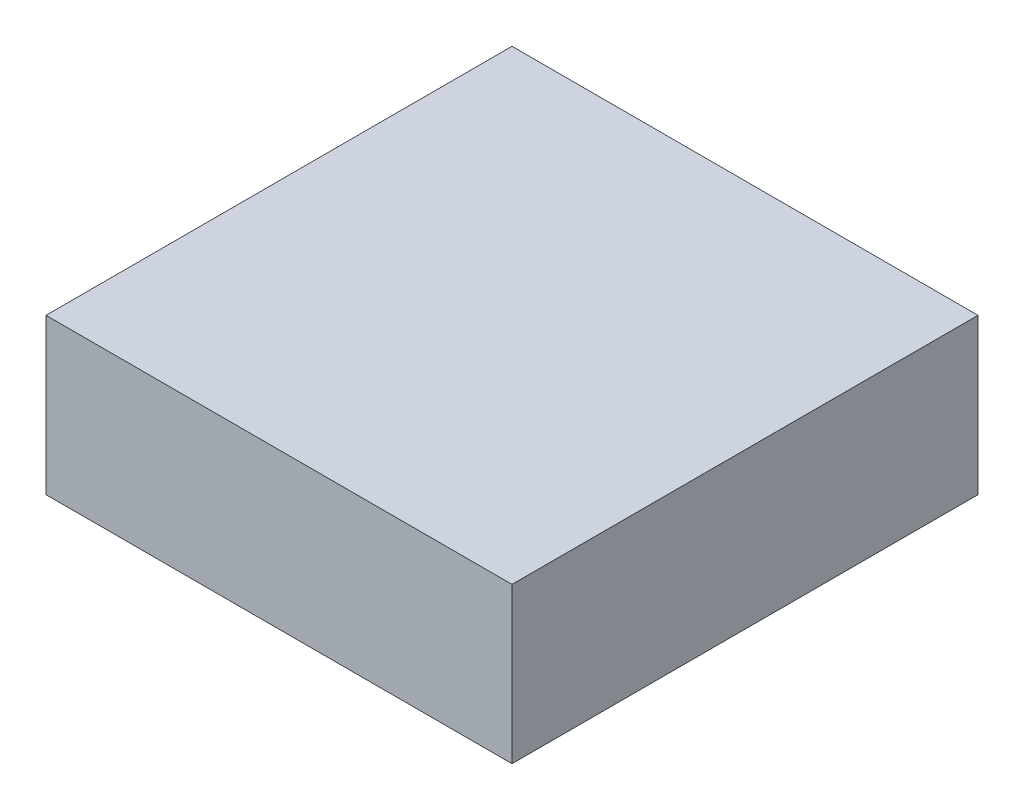
ISO-10303-21;
HEADER;
FILE_DESCRIPTION(('STEP AP214'),'2;1');
FILE_NAME('part.step','',(''),(''),'','','');
FILE_SCHEMA(('AUTOMOTIVE_DESIGN { 1 0 10303 214 1 1 1 1 }'));
ENDSEC;
DATA;
#1=APPLICATION_CONTEXT('core data for automotive mechanical design processes');
#2=APPLICATION_PROTOCOL_DEFINITION('international standard','automotive_design',2000,#1);
#3=PRODUCT_CONTEXT('',#1,'mechanical');
#4=PRODUCT('Part','Part','',(#3));
#5=PRODUCT_RELATED_PRODUCT_CATEGORY('part','',(#4));
#6=PRODUCT_DEFINITION_FORMATION('','',#4);
#7=PRODUCT_DEFINITION_CONTEXT('part definition',#1,'design');
#8=PRODUCT_DEFINITION('design','',#6,#7);
#9=PRODUCT_DEFINITION_SHAPE('','',#8);
#10=(LENGTH_UNIT() NAMED_UNIT(*) SI_UNIT(.MILLI.,.METRE.));
#11=(NAMED_UNIT(*) PLANE_ANGLE_UNIT() SI_UNIT($,.RADIAN.));
#12=(NAMED_UNIT(*) SI_UNIT($,.STERADIAN.) SOLID_ANGLE_UNIT());
#13=UNCERTAINTY_MEASURE_WITH_UNIT(LENGTH_MEASURE(1.E-05),#10,'distance_accuracy_value','');
#14=(GEOMETRIC_REPRESENTATION_CONTEXT(3) GLOBAL_UNCERTAINTY_ASSIGNED_CONTEXT((#13)) GLOBAL_UNIT_ASSIGNED_CONTEXT((#10,
#11,#12)) REPRESENTATION_CONTEXT('',''));
#15=CARTESIAN_POINT('',(0.,0.,0.));
#16=DIRECTION('',(0.,0.,1.));
#17=DIRECTION('',(1.,0.,0.));
#18=AXIS2_PLACEMENT_3D('',#15,#16,#17);
#19=CARTESIAN_POINT('',(-89.3347800287974,-30.,52.4178960442944));
#20=DIRECTION('',(-1.,0.,0.));
#21=DIRECTION('',(0.,0.,1.));
#22=AXIS2_PLACEMENT_3D('',#19,#20,#21);
#23=PLANE('',#22);
#24=DIRECTION('',(0.,0.,1.));
#25=VECTOR('',#24,1.);
#26=CARTESIAN_POINT('',(-89.3347800287974,0.,52.4178960442944));
#27=LINE('',#26,#25);
#28=CARTESIAN_POINT('',(-89.3347800287974,0.,-37.5821039557056));
#29=VERTEX_POINT('',#28);
#30=CARTESIAN_POINT('',(-89.3347800287974,0.,52.4178960442944));
#31=VERTEX_POINT('',#30);
#32=EDGE_CURVE('E109',#29,#31,#27,.T.);
#33=ORIENTED_EDGE('',*,*,#32,.F.);
#34=DIRECTION('',(0.,1.,0.));
#35=VECTOR('',#34,1.);
#36=CARTESIAN_POINT('',(-89.3347800287974,-30.,-37.5821039557056));
#37=LINE('',#36,#35);
#38=CARTESIAN_POINT('',(-89.3347800287974,-30.,-37.5821039557056));
#39=VERTEX_POINT('',#38);
#40=EDGE_CURVE('E11',#39,#29,#37,.T.);
#41=ORIENTED_EDGE('',*,*,#40,.F.);
#42=DIRECTION('',(0.,0.,1.));
#43=VECTOR('',#42,1.);
#44=CARTESIAN_POINT('',(-89.3347800287974,-30.,52.4178960442944));
#45=LINE('',#44,#43);
#46=CARTESIAN_POINT('',(-89.3347800287974,-30.,52.4178960442944));
#47=VERTEX_POINT('',#46);
#48=EDGE_CURVE('E101',#39,#47,#45,.T.);
#49=ORIENTED_EDGE('',*,*,#48,.T.);
#50=DIRECTION('',(0.,1.,0.));
#51=VECTOR('',#50,1.);
#52=CARTESIAN_POINT('',(-89.3347800287974,-30.,52.4178960442944));
#53=LINE('',#52,#51);
#54=EDGE_CURVE('E42',#47,#31,#53,.T.);
#55=ORIENTED_EDGE('',*,*,#54,.T.);
#56=EDGE_LOOP('',(#33,#41,#49,#55));
#57=FACE_BOUND('',#56,.T.);
#58=ADVANCED_FACE('F39',(#57),#23,.T.);
#59=CARTESIAN_POINT('',(-89.3347800287974,-30.,-37.5821039557056));
#60=DIRECTION('',(0.,0.,-1.));
#61=DIRECTION('',(-1.,0.,0.));
#62=AXIS2_PLACEMENT_3D('',#59,#60,#61);
#63=PLANE('',#62);
#64=DIRECTION('',(-1.,0.,0.));
#65=VECTOR('',#64,1.);
#66=CARTESIAN_POINT('',(-89.3347800287974,0.,-37.5821039557056));
#67=LINE('',#66,#65);
#68=CARTESIAN_POINT('',(0.665219971202585,0.,-37.5821039557056));
#69=VERTEX_POINT('',#68);
#70=EDGE_CURVE('E104',#69,#29,#67,.T.);
#71=ORIENTED_EDGE('',*,*,#70,.F.);
#72=DIRECTION('',(0.,1.,0.));
#73=VECTOR('',#72,1.);
#74=CARTESIAN_POINT('',(0.665219971202585,-30.,-37.5821039557056));
#75=LINE('',#74,#73);
#76=CARTESIAN_POINT('',(0.665219971202585,-30.,-37.5821039557056));
#77=VERTEX_POINT('',#76);
#78=EDGE_CURVE('E49',#77,#69,#75,.T.);
#79=ORIENTED_EDGE('',*,*,#78,.F.);
#80=DIRECTION('',(-1.,0.,0.));
#81=VECTOR('',#80,1.);
#82=CARTESIAN_POINT('',(-89.3347800287974,-30.,-37.5821039557056));
#83=LINE('',#82,#81);
#84=EDGE_CURVE('E96',#77,#39,#83,.T.);
#85=ORIENTED_EDGE('',*,*,#84,.T.);
#86=ORIENTED_EDGE('',*,*,#40,.T.);
#87=EDGE_LOOP('',(#71,#79,#85,#86));
#88=FACE_BOUND('',#87,.T.);
#89=ADVANCED_FACE('F125',(#88),#63,.T.);
#90=CARTESIAN_POINT('',(0.665219971202585,-30.,52.4178960442944));
#91=DIRECTION('',(1.,0.,0.));
#92=DIRECTION('',(0.,0.,-1.));
#93=AXIS2_PLACEMENT_3D('',#90,#91,#92);
#94=PLANE('',#93);
#95=DIRECTION('',(0.,0.,-1.));
#96=VECTOR('',#95,1.);
#97=CARTESIAN_POINT('',(0.665219971202585,0.,52.4178960442944));
#98=LINE('',#97,#96);
#99=CARTESIAN_POINT('',(0.665219971202585,0.,52.4178960442944));
#100=VERTEX_POINT('',#99);
#101=EDGE_CURVE('E90',#100,#69,#98,.T.);
#102=ORIENTED_EDGE('',*,*,#101,.F.);
#103=DIRECTION('',(0.,1.,0.));
#104=VECTOR('',#103,1.);
#105=CARTESIAN_POINT('',(0.665219971202585,-30.,52.4178960442944));
#106=LINE('',#105,#104);
#107=CARTESIAN_POINT('',(0.665219971202585,-30.,52.4178960442944));
#108=VERTEX_POINT('',#107);
#109=EDGE_CURVE('E85',#108,#100,#106,.T.);
#110=ORIENTED_EDGE('',*,*,#109,.F.);
#111=DIRECTION('',(0.,0.,-1.));
#112=VECTOR('',#111,1.);
#113=CARTESIAN_POINT('',(0.665219971202585,-30.,52.4178960442944));
#114=LINE('',#113,#112);
#115=EDGE_CURVE('E88',#108,#77,#114,.T.);
#116=ORIENTED_EDGE('',*,*,#115,.T.);
#117=ORIENTED_EDGE('',*,*,#78,.T.);
#118=EDGE_LOOP('',(#102,#110,#116,#117));
#119=FACE_BOUND('',#118,.T.);
#120=ADVANCED_FACE('F87',(#119),#94,.T.);
#121=CARTESIAN_POINT('',(-89.3347800287974,-30.,52.4178960442944));
#122=DIRECTION('',(0.,0.,1.));
#123=DIRECTION('',(1.,0.,0.));
#124=AXIS2_PLACEMENT_3D('',#121,#122,#123);
#125=PLANE('',#124);
#126=DIRECTION('',(1.,0.,0.));
#127=VECTOR('',#126,1.);
#128=CARTESIAN_POINT('',(-89.3347800287974,0.,52.4178960442944));
#129=LINE('',#128,#127);
#130=EDGE_CURVE('E113',#31,#100,#129,.T.);
#131=ORIENTED_EDGE('',*,*,#130,.F.);
#132=ORIENTED_EDGE('',*,*,#54,.F.);
#133=DIRECTION('',(1.,0.,0.));
#134=VECTOR('',#133,1.);
#135=CARTESIAN_POINT('',(-89.3347800287974,-30.,52.4178960442944));
#136=LINE('',#135,#134);
#137=EDGE_CURVE('E95',#47,#108,#136,.T.);
#138=ORIENTED_EDGE('',*,*,#137,.T.);
#139=ORIENTED_EDGE('',*,*,#109,.T.);
#140=EDGE_LOOP('',(#131,#132,#138,#139));
#141=FACE_BOUND('',#140,.T.);
#142=ADVANCED_FACE('F99',(#141),#125,.T.);
#143=CARTESIAN_POINT('',(0.,-30.,0.));
#144=DIRECTION('',(0.,-1.,0.));
#145=DIRECTION('',(0.,0.,-1.));
#146=AXIS2_PLACEMENT_3D('',#143,#144,#145);
#147=PLANE('',#146);
#148=ORIENTED_EDGE('',*,*,#48,.F.);
#149=ORIENTED_EDGE('',*,*,#84,.F.);
#150=ORIENTED_EDGE('',*,*,#115,.F.);
#151=ORIENTED_EDGE('',*,*,#137,.F.);
#152=EDGE_LOOP('',(#148,#149,#150,#151));
#153=FACE_BOUND('',#152,.T.);
#154=ADVANCED_FACE('F94',(#153),#147,.T.);
#155=CARTESIAN_POINT('',(0.,0.,0.));
#156=DIRECTION('',(0.,-1.,0.));
#157=DIRECTION('',(0.,0.,-1.));
#158=AXIS2_PLACEMENT_3D('',#155,#156,#157);
#159=PLANE('',#158);
#160=ORIENTED_EDGE('',*,*,#32,.T.);
#161=ORIENTED_EDGE('',*,*,#130,.T.);
#162=ORIENTED_EDGE('',*,*,#101,.T.);
#163=ORIENTED_EDGE('',*,*,#70,.T.);
#164=EDGE_LOOP('',(#160,#161,#162,#163));
#165=FACE_BOUND('',#164,.T.);
#166=ADVANCED_FACE('F124',(#165),#159,.F.);
#167=CLOSED_SHELL('',(#58,#89,#120,#142,#154,#166));
#168=MANIFOLD_SOLID_BREP('B2',#167);
#169=ADVANCED_BREP_SHAPE_REPRESENTATION('',(#18,#168),#14);
#170=SHAPE_DEFINITION_REPRESENTATION(#9,#169);
ENDSEC;
END-ISO-10303-21;
